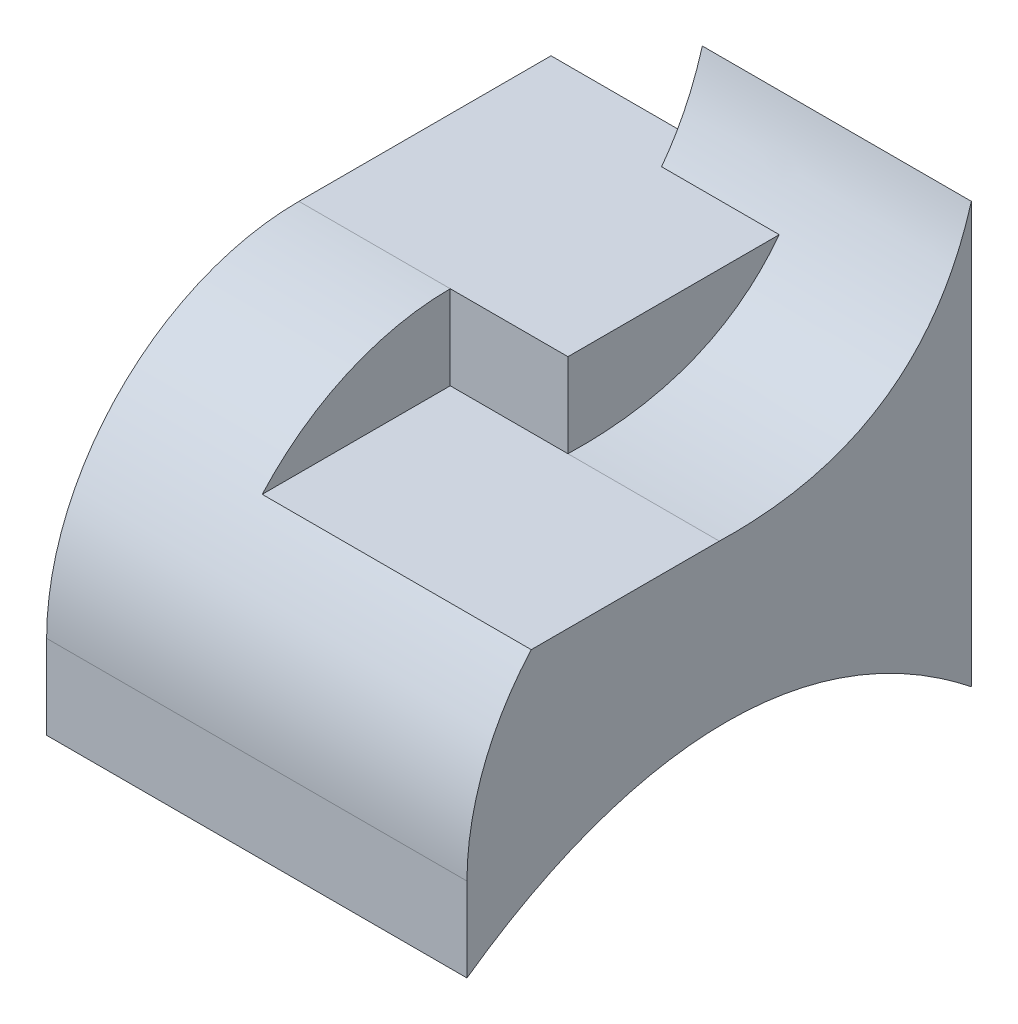
ISO-10303-21;
HEADER;
FILE_DESCRIPTION(('STEP AP214'),'2;1');
FILE_NAME('part.step','',(''),(''),'','','');
FILE_SCHEMA(('AUTOMOTIVE_DESIGN { 1 0 10303 214 1 1 1 1 }'));
ENDSEC;
DATA;
#1=APPLICATION_CONTEXT('core data for automotive mechanical design processes');
#2=APPLICATION_PROTOCOL_DEFINITION('international standard','automotive_design',2000,#1);
#3=PRODUCT_CONTEXT('',#1,'mechanical');
#4=PRODUCT('Part','Part','',(#3));
#5=PRODUCT_RELATED_PRODUCT_CATEGORY('part','',(#4));
#6=PRODUCT_DEFINITION_FORMATION('','',#4);
#7=PRODUCT_DEFINITION_CONTEXT('part definition',#1,'design');
#8=PRODUCT_DEFINITION('design','',#6,#7);
#9=PRODUCT_DEFINITION_SHAPE('','',#8);
#10=(LENGTH_UNIT() NAMED_UNIT(*) SI_UNIT(.MILLI.,.METRE.));
#11=(NAMED_UNIT(*) PLANE_ANGLE_UNIT() SI_UNIT($,.RADIAN.));
#12=(NAMED_UNIT(*) SI_UNIT($,.STERADIAN.) SOLID_ANGLE_UNIT());
#13=UNCERTAINTY_MEASURE_WITH_UNIT(LENGTH_MEASURE(1.E-05),#10,'distance_accuracy_value','');
#14=(GEOMETRIC_REPRESENTATION_CONTEXT(3) GLOBAL_UNCERTAINTY_ASSIGNED_CONTEXT((#13)) GLOBAL_UNIT_ASSIGNED_CONTEXT((#10,
#11,#12)) REPRESENTATION_CONTEXT('',''));
#15=CARTESIAN_POINT('',(0.,0.,0.));
#16=DIRECTION('',(0.,0.,1.));
#17=DIRECTION('',(1.,0.,0.));
#18=AXIS2_PLACEMENT_3D('',#15,#16,#17);
#19=CARTESIAN_POINT('',(3.2,0.,0.998443773012467));
#20=DIRECTION('',(0.,0.,-1.));
#21=DIRECTION('',(0.,1.,0.));
#22=AXIS2_PLACEMENT_3D('',#19,#20,#21);
#23=PLANE('',#22);
#24=DIRECTION('',(-1.,0.,0.));
#25=VECTOR('',#24,1.);
#26=CARTESIAN_POINT('',(5.,3.,0.998443773012467));
#27=LINE('',#26,#25);
#28=CARTESIAN_POINT('',(3.2,3.,0.998443773012467));
#29=VERTEX_POINT('',#28);
#30=CARTESIAN_POINT('',(1.8,3.,0.998443773012467));
#31=VERTEX_POINT('',#30);
#32=EDGE_CURVE('E299',#29,#31,#27,.T.);
#33=ORIENTED_EDGE('',*,*,#32,.F.);
#34=DIRECTION('',(0.,-1.,0.));
#35=VECTOR('',#34,1.);
#36=CARTESIAN_POINT('',(3.2,0.,0.998443773012467));
#37=LINE('',#36,#35);
#38=CARTESIAN_POINT('',(3.2,4.,0.998443773012467));
#39=VERTEX_POINT('',#38);
#40=EDGE_CURVE('E129',#39,#29,#37,.T.);
#41=ORIENTED_EDGE('',*,*,#40,.F.);
#42=DIRECTION('',(-1.,0.,0.));
#43=VECTOR('',#42,1.);
#44=CARTESIAN_POINT('',(3.2,4.,0.998443773012467));
#45=LINE('',#44,#43);
#46=CARTESIAN_POINT('',(1.8,4.,0.998443773012467));
#47=VERTEX_POINT('',#46);
#48=EDGE_CURVE('E64',#39,#47,#45,.T.);
#49=ORIENTED_EDGE('',*,*,#48,.T.);
#50=DIRECTION('',(0.,1.,0.));
#51=VECTOR('',#50,1.);
#52=CARTESIAN_POINT('',(1.8,0.,0.998443773012467));
#53=LINE('',#52,#51);
#54=EDGE_CURVE('E111',#31,#47,#53,.T.);
#55=ORIENTED_EDGE('',*,*,#54,.F.);
#56=EDGE_LOOP('',(#33,#41,#49,#55));
#57=FACE_BOUND('',#56,.T.);
#58=ADVANCED_FACE('F35',(#57),#23,.F.);
#59=CARTESIAN_POINT('',(3.2,0.,-2.00038877290963));
#60=CARTESIAN_POINT('',(3.2,2.19293429517951,0.759001549130415));
#61=CARTESIAN_POINT('',(3.2,0.,3.99961122709037));
#62=B_SPLINE_CURVE_WITH_KNOTS('',2,(#59,#60,#61),.UNSPECIFIED.,.F.,.F.,(3,3),(0.,1.),.UNSPECIFIED.);
#63=DIRECTION('',(-1.,0.,0.));
#64=VECTOR('',#63,1.);
#65=SURFACE_OF_LINEAR_EXTRUSION('',#62,#64);
#66=DIRECTION('',(-1.,0.,0.));
#67=VECTOR('',#66,1.);
#68=CARTESIAN_POINT('',(3.2,0.,-2.00038877290963));
#69=LINE('',#68,#67);
#70=CARTESIAN_POINT('',(1.8,0.,-2.00038877290963));
#71=VERTEX_POINT('',#70);
#72=CARTESIAN_POINT('',(0.,0.,-2.00038877290963));
#73=VERTEX_POINT('',#72);
#74=EDGE_CURVE('E47',#71,#73,#69,.T.);
#75=ORIENTED_EDGE('',*,*,#74,.F.);
#76=CARTESIAN_POINT('',(1.8,0.,-2.00038877290963));
#77=CARTESIAN_POINT('',(1.8,2.19293429517951,0.759001549130415));
#78=CARTESIAN_POINT('',(1.8,0.,3.99961122709037));
#79=B_SPLINE_CURVE_WITH_KNOTS('',2,(#76,#77,#78),.UNSPECIFIED.,.F.,.F.,(3,3),(0.,1.),.UNSPECIFIED.);
#80=CARTESIAN_POINT('',(1.8,1.09474341744829,0.998443773019641));
#81=VERTEX_POINT('',#80);
#82=EDGE_CURVE('E186',#71,#81,#79,.T.);
#83=ORIENTED_EDGE('',*,*,#82,.T.);
#84=DIRECTION('',(-1.,0.,0.));
#85=VECTOR('',#84,1.);
#86=CARTESIAN_POINT('',(1.8,1.09474341744843,0.998443773012467));
#87=LINE('',#86,#85);
#88=CARTESIAN_POINT('',(0.,1.09474341744843,0.998443773012467));
#89=VERTEX_POINT('',#88);
#90=EDGE_CURVE('E149',#81,#89,#87,.T.);
#91=ORIENTED_EDGE('',*,*,#90,.T.);
#92=CARTESIAN_POINT('',(0.,0.,-2.00038877290963));
#93=CARTESIAN_POINT('',(0.,2.19293429517951,0.759001549130415));
#94=CARTESIAN_POINT('',(0.,0.,3.99961122709037));
#95=B_SPLINE_CURVE_WITH_KNOTS('',2,(#92,#93,#94),.UNSPECIFIED.,.F.,.F.,(3,3),(0.,1.),.UNSPECIFIED.);
#96=EDGE_CURVE('E102',#73,#89,#95,.T.);
#97=ORIENTED_EDGE('',*,*,#96,.F.);
#98=EDGE_LOOP('',(#75,#83,#91,#97));
#99=FACE_BOUND('',#98,.T.);
#100=ADVANCED_FACE('F37',(#99),#65,.T.);
#101=CARTESIAN_POINT('',(3.2,4.,0.));
#102=DIRECTION('',(0.,1.,0.));
#103=DIRECTION('',(0.,0.,1.));
#104=AXIS2_PLACEMENT_3D('',#101,#102,#103);
#105=PLANE('',#104);
#106=DIRECTION('',(0.,0.,-1.));
#107=VECTOR('',#106,1.);
#108=CARTESIAN_POINT('',(3.2,4.,0.));
#109=LINE('',#108,#107);
#110=CARTESIAN_POINT('',(3.2,4.00000000968665,-1.51495017286256));
#111=VERTEX_POINT('',#110);
#112=EDGE_CURVE('E92',#39,#111,#109,.T.);
#113=ORIENTED_EDGE('',*,*,#112,.T.);
#114=DIRECTION('',(-1.,0.,0.));
#115=VECTOR('',#114,1.);
#116=CARTESIAN_POINT('',(5.,4.,-1.51495016551167));
#117=LINE('',#116,#115);
#118=CARTESIAN_POINT('',(1.8,4.00000000968665,-1.51495017286256));
#119=VERTEX_POINT('',#118);
#120=EDGE_CURVE('E289',#111,#119,#117,.T.);
#121=ORIENTED_EDGE('',*,*,#120,.T.);
#122=DIRECTION('',(0.,0.,-1.));
#123=VECTOR('',#122,1.);
#124=CARTESIAN_POINT('',(1.8,4.,0.));
#125=LINE('',#124,#123);
#126=CARTESIAN_POINT('',(1.8,4.,-2.00038877290963));
#127=VERTEX_POINT('',#126);
#128=EDGE_CURVE('E188',#119,#127,#125,.T.);
#129=ORIENTED_EDGE('',*,*,#128,.T.);
#130=DIRECTION('',(-1.,0.,0.));
#131=VECTOR('',#130,1.);
#132=CARTESIAN_POINT('',(3.2,4.,-2.00038877290963));
#133=LINE('',#132,#131);
#134=CARTESIAN_POINT('',(0.,4.,-2.00038877290963));
#135=VERTEX_POINT('',#134);
#136=EDGE_CURVE('E87',#127,#135,#133,.T.);
#137=ORIENTED_EDGE('',*,*,#136,.T.);
#138=DIRECTION('',(0.,0.,-1.));
#139=VECTOR('',#138,1.);
#140=CARTESIAN_POINT('',(0.,4.,0.));
#141=LINE('',#140,#139);
#142=CARTESIAN_POINT('',(0.,4.,0.998443773012467));
#143=VERTEX_POINT('',#142);
#144=EDGE_CURVE('E81',#143,#135,#141,.T.);
#145=ORIENTED_EDGE('',*,*,#144,.F.);
#146=DIRECTION('',(-1.,0.,0.));
#147=VECTOR('',#146,1.);
#148=CARTESIAN_POINT('',(1.8,4.,0.998443773012467));
#149=LINE('',#148,#147);
#150=EDGE_CURVE('E84',#47,#143,#149,.T.);
#151=ORIENTED_EDGE('',*,*,#150,.F.);
#152=ORIENTED_EDGE('',*,*,#48,.F.);
#153=EDGE_LOOP('',(#113,#121,#129,#137,#145,#151,#152));
#154=FACE_BOUND('',#153,.T.);
#155=ADVANCED_FACE('F83',(#154),#105,.T.);
#156=CARTESIAN_POINT('',(3.2,0.,0.));
#157=DIRECTION('',(1.,0.,0.));
#158=DIRECTION('',(0.,0.,-1.));
#159=AXIS2_PLACEMENT_3D('',#156,#157,#158);
#160=PLANE('',#159);
#161=ORIENTED_EDGE('',*,*,#40,.T.);
#162=CARTESIAN_POINT('',(3.2,5.00085656886673,-2.00038877290963));
#163=CARTESIAN_POINT('',(3.2,2.93147543190315,-1.39753577973207));
#164=CARTESIAN_POINT('',(3.2,3.,0.998443773012467));
#165=B_SPLINE_CURVE_WITH_KNOTS('',2,(#162,#163,#164),.UNSPECIFIED.,.F.,.F.,(3,3),(0.,1.),.UNSPECIFIED.);
#166=EDGE_CURVE('E285',#29,#111,#165,.F.);
#167=ORIENTED_EDGE('',*,*,#166,.T.);
#168=ORIENTED_EDGE('',*,*,#112,.F.);
#169=EDGE_LOOP('',(#161,#167,#168));
#170=FACE_BOUND('',#169,.T.);
#171=ADVANCED_FACE('F212',(#170),#160,.T.);
#172=CARTESIAN_POINT('',(1.8,0.,0.));
#173=DIRECTION('',(-1.,0.,0.));
#174=DIRECTION('',(0.,0.,1.));
#175=AXIS2_PLACEMENT_3D('',#172,#173,#174);
#176=PLANE('',#175);
#177=DIRECTION('',(0.,0.,1.));
#178=VECTOR('',#177,1.);
#179=CARTESIAN_POINT('',(1.8,3.,0.));
#180=LINE('',#179,#178);
#181=CARTESIAN_POINT('',(1.8,3.,3.23496595014368));
#182=VERTEX_POINT('',#181);
#183=EDGE_CURVE('E259',#31,#182,#180,.T.);
#184=ORIENTED_EDGE('',*,*,#183,.F.);
#185=ORIENTED_EDGE('',*,*,#54,.T.);
#186=CARTESIAN_POINT('',(1.8,0.998709843022222,0.998321070112596));
#187=DIRECTION('',(-1.,0.,0.));
#188=DIRECTION('',(0.,0.,1.));
#189=AXIS2_PLACEMENT_3D('',#186,#187,#188);
#190=CIRCLE('',#189,3.00129015787968);
#191=EDGE_CURVE('E100',#182,#47,#190,.T.);
#192=ORIENTED_EDGE('',*,*,#191,.F.);
#193=EDGE_LOOP('',(#184,#185,#192));
#194=FACE_BOUND('',#193,.T.);
#195=ADVANCED_FACE('F215',(#194),#176,.F.);
#196=CARTESIAN_POINT('',(3.2,0.,-2.00038877290963));
#197=DIRECTION('',(0.,0.,-1.));
#198=DIRECTION('',(-1.,0.,0.));
#199=AXIS2_PLACEMENT_3D('',#196,#197,#198);
#200=PLANE('',#199);
#201=CARTESIAN_POINT('',(5.,0.,-2.00038877290963));
#202=VERTEX_POINT('',#201);
#203=EDGE_CURVE('E11',#202,#71,#69,.T.);
#204=ORIENTED_EDGE('',*,*,#203,.T.);
#205=ORIENTED_EDGE('',*,*,#74,.T.);
#206=DIRECTION('',(0.,-1.,0.));
#207=VECTOR('',#206,1.);
#208=CARTESIAN_POINT('',(0.,0.,-2.00038877290963));
#209=LINE('',#208,#207);
#210=EDGE_CURVE('E93',#135,#73,#209,.T.);
#211=ORIENTED_EDGE('',*,*,#210,.F.);
#212=ORIENTED_EDGE('',*,*,#136,.F.);
#213=DIRECTION('',(0.,1.,0.));
#214=VECTOR('',#213,1.);
#215=CARTESIAN_POINT('',(1.8,0.,-2.00038877290963));
#216=LINE('',#215,#214);
#217=CARTESIAN_POINT('',(1.8,5.00085656886673,-2.00038877290963));
#218=VERTEX_POINT('',#217);
#219=EDGE_CURVE('E176',#127,#218,#216,.T.);
#220=ORIENTED_EDGE('',*,*,#219,.T.);
#221=DIRECTION('',(-1.,0.,0.));
#222=VECTOR('',#221,1.);
#223=CARTESIAN_POINT('',(5.,5.00085656886673,-2.00038877290963));
#224=LINE('',#223,#222);
#225=CARTESIAN_POINT('',(5.,5.00085656886673,-2.00038877290963));
#226=VERTEX_POINT('',#225);
#227=EDGE_CURVE('E286',#226,#218,#224,.T.);
#228=ORIENTED_EDGE('',*,*,#227,.F.);
#229=DIRECTION('',(0.,1.,0.));
#230=VECTOR('',#229,1.);
#231=CARTESIAN_POINT('',(5.,0.,-2.00038877290963));
#232=LINE('',#231,#230);
#233=EDGE_CURVE('E239',#202,#226,#232,.T.);
#234=ORIENTED_EDGE('',*,*,#233,.F.);
#235=EDGE_LOOP('',(#204,#205,#211,#212,#220,#228,#234));
#236=FACE_BOUND('',#235,.T.);
#237=ADVANCED_FACE('F219',(#236),#200,.T.);
#238=CARTESIAN_POINT('',(0.,0.,0.));
#239=DIRECTION('',(1.,0.,0.));
#240=DIRECTION('',(0.,0.,-1.));
#241=AXIS2_PLACEMENT_3D('',#238,#239,#240);
#242=PLANE('',#241);
#243=ORIENTED_EDGE('',*,*,#96,.T.);
#244=CARTESIAN_POINT('',(0.,-6.0818017291688E-10,-2.00038877361408));
#245=CARTESIAN_POINT('',(0.,0.0384968697528258,-1.95194779127023));
#246=CARTESIAN_POINT('',(0.,1.53765621584237,-0.010050324715731));
#247=CARTESIAN_POINT('',(0.,1.34308431968852,2.11047516855166));
#248=CARTESIAN_POINT('',(0.,0.,3.99961122638592));
#249=B_SPLINE_CURVE_WITH_KNOTS('',3,(#244,#245,#246,#247,#248),.UNSPECIFIED.,.F.,.F.,(4,1,4),
(0.,0.024991414491378,1.),.UNSPECIFIED.);
#250=CARTESIAN_POINT('',(0.,0.,3.99961122709037));
#251=VERTEX_POINT('',#250);
#252=EDGE_CURVE('E115',#89,#251,#249,.T.);
#253=ORIENTED_EDGE('',*,*,#252,.T.);
#254=DIRECTION('',(0.,1.,-7.05365623463801E-10));
#255=VECTOR('',#254,1.);
#256=CARTESIAN_POINT('',(0.,2.82118826680942E-09,3.99961122709037));
#257=LINE('',#256,#255);
#258=CARTESIAN_POINT('',(0.,0.998709843022353,3.99961122638592));
#259=VERTEX_POINT('',#258);
#260=EDGE_CURVE('E110',#251,#259,#257,.T.);
#261=ORIENTED_EDGE('',*,*,#260,.T.);
#262=CARTESIAN_POINT('',(0.,0.998709843022222,0.998321070112596));
#263=DIRECTION('',(-1.,0.,0.));
#264=DIRECTION('',(0.,0.,1.));
#265=AXIS2_PLACEMENT_3D('',#262,#263,#264);
#266=CIRCLE('',#265,3.00129015787968);
#267=EDGE_CURVE('E98',#259,#143,#266,.T.);
#268=ORIENTED_EDGE('',*,*,#267,.T.);
#269=ORIENTED_EDGE('',*,*,#144,.T.);
#270=ORIENTED_EDGE('',*,*,#210,.T.);
#271=EDGE_LOOP('',(#243,#253,#261,#268,#269,#270));
#272=FACE_BOUND('',#271,.T.);
#273=ADVANCED_FACE('F107',(#272),#242,.F.);
#274=CARTESIAN_POINT('',(1.8,0.998709843022222,0.998321070112596));
#275=DIRECTION('',(-1.,0.,0.));
#276=DIRECTION('',(0.,0.,1.));
#277=AXIS2_PLACEMENT_3D('',#274,#275,#276);
#278=CYLINDRICAL_SURFACE('',#277,3.00129015787968);
#279=ORIENTED_EDGE('',*,*,#267,.F.);
#280=DIRECTION('',(-1.,0.,0.));
#281=VECTOR('',#280,1.);
#282=CARTESIAN_POINT('',(1.8,0.998709843022353,3.99961122638592));
#283=LINE('',#282,#281);
#284=CARTESIAN_POINT('',(5.,0.998709843022353,3.99961122638592));
#285=VERTEX_POINT('',#284);
#286=EDGE_CURVE('E103',#285,#259,#283,.T.);
#287=ORIENTED_EDGE('',*,*,#286,.F.);
#288=CARTESIAN_POINT('',(5.,0.998709843022222,0.998321070112596));
#289=DIRECTION('',(1.,0.,0.));
#290=DIRECTION('',(0.,0.,-1.));
#291=AXIS2_PLACEMENT_3D('',#288,#289,#290);
#292=CIRCLE('',#291,3.00129015787968);
#293=CARTESIAN_POINT('',(5.,3.,3.23496595014368));
#294=VERTEX_POINT('',#293);
#295=EDGE_CURVE('E317',#294,#285,#292,.T.);
#296=ORIENTED_EDGE('',*,*,#295,.F.);
#297=DIRECTION('',(-1.,0.,0.));
#298=VECTOR('',#297,1.);
#299=CARTESIAN_POINT('',(5.,3.,3.23496595014368));
#300=LINE('',#299,#298);
#301=EDGE_CURVE('E55',#294,#182,#300,.T.);
#302=ORIENTED_EDGE('',*,*,#301,.T.);
#303=ORIENTED_EDGE('',*,*,#191,.T.);
#304=ORIENTED_EDGE('',*,*,#150,.T.);
#305=EDGE_LOOP('',(#279,#287,#296,#302,#303,#304));
#306=FACE_BOUND('',#305,.T.);
#307=ADVANCED_FACE('F96',(#306),#278,.T.);
#308=CARTESIAN_POINT('',(1.8,2.82118826680942E-09,3.99961122709037));
#309=DIRECTION('',(0.,7.05365623463801E-10,1.));
#310=DIRECTION('',(0.,-1.,7.05365623463801E-10));
#311=AXIS2_PLACEMENT_3D('',#308,#309,#310);
#312=PLANE('',#311);
#313=ORIENTED_EDGE('',*,*,#260,.F.);
#314=DIRECTION('',(-1.,0.,0.));
#315=VECTOR('',#314,1.);
#316=CARTESIAN_POINT('',(1.8,0.,3.99961122709037));
#317=LINE('',#316,#315);
#318=CARTESIAN_POINT('',(1.8,0.,3.99961122638592));
#319=VERTEX_POINT('',#318);
#320=EDGE_CURVE('E120',#319,#251,#317,.T.);
#321=ORIENTED_EDGE('',*,*,#320,.F.);
#322=DIRECTION('',(-1.,0.,0.));
#323=VECTOR('',#322,1.);
#324=CARTESIAN_POINT('',(5.,0.,3.99961122638592));
#325=LINE('',#324,#323);
#326=CARTESIAN_POINT('',(5.,0.,3.99961122638592));
#327=VERTEX_POINT('',#326);
#328=EDGE_CURVE('E183',#327,#319,#325,.T.);
#329=ORIENTED_EDGE('',*,*,#328,.F.);
#330=DIRECTION('',(0.,-1.,7.05365623463801E-10));
#331=VECTOR('',#330,1.);
#332=CARTESIAN_POINT('',(5.,2.82118826680942E-09,3.99961122709037));
#333=LINE('',#332,#331);
#334=EDGE_CURVE('E255',#285,#327,#333,.T.);
#335=ORIENTED_EDGE('',*,*,#334,.F.);
#336=ORIENTED_EDGE('',*,*,#286,.T.);
#337=EDGE_LOOP('',(#313,#321,#329,#335,#336));
#338=FACE_BOUND('',#337,.T.);
#339=ADVANCED_FACE('F180',(#338),#312,.T.);
#340=CARTESIAN_POINT('',(1.8,-6.0818017291688E-10,-2.00038877361408));
#341=CARTESIAN_POINT('',(1.8,0.0384968697528258,-1.95194779127023));
#342=CARTESIAN_POINT('',(1.8,1.53765621584237,-0.010050324715731));
#343=CARTESIAN_POINT('',(1.8,1.34308431968852,2.11047516855166));
#344=CARTESIAN_POINT('',(1.8,0.,3.99961122638592));
#345=B_SPLINE_CURVE_WITH_KNOTS('',3,(#340,#341,#342,#343,#344),.UNSPECIFIED.,.F.,.F.,(4,1,4),
(0.,0.024991414491378,1.),.UNSPECIFIED.);
#346=DIRECTION('',(-1.,0.,0.));
#347=VECTOR('',#346,1.);
#348=SURFACE_OF_LINEAR_EXTRUSION('',#345,#347);
#349=ORIENTED_EDGE('',*,*,#252,.F.);
#350=ORIENTED_EDGE('',*,*,#90,.F.);
#351=CARTESIAN_POINT('',(1.8,1.09470558690868,1.00034812833686));
#352=VERTEX_POINT('',#351);
#353=EDGE_CURVE('E113',#81,#352,#345,.T.);
#354=ORIENTED_EDGE('',*,*,#353,.T.);
#355=CARTESIAN_POINT('',(1.8,0.,3.99961122709037));
#356=CARTESIAN_POINT('',(1.8,0.689234167858044,3.03057006386221));
#357=CARTESIAN_POINT('',(1.8,1.07431234112784,2.01544538122989));
#358=CARTESIAN_POINT('',(1.8,1.09470558690859,1.0003481283413));
#359=B_SPLINE_CURVE_WITH_KNOTS('',3,(#355,#356,#357,#358),.UNSPECIFIED.,.F.,.F.,(4,4),(0.,
0.499859126314224),.UNSPECIFIED.);
#360=EDGE_CURVE('E163',#319,#352,#359,.T.);
#361=ORIENTED_EDGE('',*,*,#360,.F.);
#362=ORIENTED_EDGE('',*,*,#320,.T.);
#363=EDGE_LOOP('',(#349,#350,#354,#361,#362));
#364=FACE_BOUND('',#363,.T.);
#365=ADVANCED_FACE('F166',(#364),#348,.T.);
#366=CARTESIAN_POINT('',(5.,0.,3.99961122709037));
#367=CARTESIAN_POINT('',(5.,1.37885682500228,2.06098269714132));
#368=CARTESIAN_POINT('',(5.,1.54040382059394,-0.0620838256227896));
#369=CARTESIAN_POINT('',(5.,0.,-2.00038877290963));
#370=B_SPLINE_CURVE_WITH_KNOTS('',3,(#366,#367,#368,#369),.UNSPECIFIED.,.F.,.F.,(4,4),(0.,1.),.UNSPECIFIED.);
#371=DIRECTION('',(-1.,0.,0.));
#372=VECTOR('',#371,1.);
#373=SURFACE_OF_LINEAR_EXTRUSION('',#370,#372);
#374=ORIENTED_EDGE('',*,*,#203,.F.);
#375=EDGE_CURVE('E246',#327,#202,#370,.T.);
#376=ORIENTED_EDGE('',*,*,#375,.F.);
#377=ORIENTED_EDGE('',*,*,#328,.T.);
#378=ORIENTED_EDGE('',*,*,#360,.T.);
#379=ORIENTED_EDGE('',*,*,#353,.F.);
#380=CARTESIAN_POINT('',(1.8,0.,3.99961122709037));
#381=CARTESIAN_POINT('',(1.8,1.37885682500228,2.06098269714132));
#382=CARTESIAN_POINT('',(1.8,1.54040382059394,-0.0620838256227896));
#383=CARTESIAN_POINT('',(1.8,0.,-2.00038877290963));
#384=B_SPLINE_CURVE_WITH_KNOTS('',3,(#380,#381,#382,#383),.UNSPECIFIED.,.F.,.F.,(4,4),(0.,1.),.UNSPECIFIED.);
#385=EDGE_CURVE('E177',#81,#71,#384,.T.);
#386=ORIENTED_EDGE('',*,*,#385,.T.);
#387=EDGE_LOOP('',(#374,#376,#377,#378,#379,#386));
#388=FACE_BOUND('',#387,.T.);
#389=ADVANCED_FACE('F210',(#388),#373,.F.);
#390=CARTESIAN_POINT('',(1.8,0.,0.));
#391=DIRECTION('',(1.,0.,0.));
#392=DIRECTION('',(0.,0.,-1.));
#393=AXIS2_PLACEMENT_3D('',#390,#391,#392);
#394=PLANE('',#393);
#395=ORIENTED_EDGE('',*,*,#82,.F.);
#396=ORIENTED_EDGE('',*,*,#385,.F.);
#397=EDGE_LOOP('',(#395,#396));
#398=FACE_BOUND('',#397,.T.);
#399=ADVANCED_FACE('F272',(#398),#394,.F.);
#400=CARTESIAN_POINT('',(5.,5.00085656886673,-2.00038877290963));
#401=CARTESIAN_POINT('',(5.,2.93147543190315,-1.39753577973207));
#402=CARTESIAN_POINT('',(5.,3.,0.998443773012467));
#403=B_SPLINE_CURVE_WITH_KNOTS('',2,(#400,#401,#402),.UNSPECIFIED.,.F.,.F.,(3,3),(0.,1.),.UNSPECIFIED.);
#404=DIRECTION('',(-1.,0.,0.));
#405=VECTOR('',#404,1.);
#406=SURFACE_OF_LINEAR_EXTRUSION('',#403,#405);
#407=ORIENTED_EDGE('',*,*,#120,.F.);
#408=ORIENTED_EDGE('',*,*,#166,.F.);
#409=CARTESIAN_POINT('',(5.,3.,0.998443773012467));
#410=VERTEX_POINT('',#409);
#411=EDGE_CURVE('E292',#410,#29,#27,.T.);
#412=ORIENTED_EDGE('',*,*,#411,.F.);
#413=EDGE_CURVE('E257',#226,#410,#403,.T.);
#414=ORIENTED_EDGE('',*,*,#413,.F.);
#415=ORIENTED_EDGE('',*,*,#227,.T.);
#416=CARTESIAN_POINT('',(1.8,5.00085656886673,-2.00038877290963));
#417=CARTESIAN_POINT('',(1.8,2.93147543190315,-1.39753577973207));
#418=CARTESIAN_POINT('',(1.8,3.,0.998443773012467));
#419=B_SPLINE_CURVE_WITH_KNOTS('',2,(#416,#417,#418),.UNSPECIFIED.,.F.,.F.,(3,3),(0.,1.),.UNSPECIFIED.);
#420=EDGE_CURVE('E324',#218,#119,#419,.T.);
#421=ORIENTED_EDGE('',*,*,#420,.T.);
#422=EDGE_LOOP('',(#407,#408,#412,#414,#415,#421));
#423=FACE_BOUND('',#422,.T.);
#424=ADVANCED_FACE('F273',(#423),#406,.F.);
#425=CARTESIAN_POINT('',(5.,3.,0.));
#426=DIRECTION('',(0.,-1.,0.));
#427=DIRECTION('',(0.,0.,-1.));
#428=AXIS2_PLACEMENT_3D('',#425,#426,#427);
#429=PLANE('',#428);
#430=ORIENTED_EDGE('',*,*,#183,.T.);
#431=ORIENTED_EDGE('',*,*,#301,.F.);
#432=DIRECTION('',(0.,0.,1.));
#433=VECTOR('',#432,1.);
#434=CARTESIAN_POINT('',(5.,3.,0.));
#435=LINE('',#434,#433);
#436=EDGE_CURVE('E332',#410,#294,#435,.T.);
#437=ORIENTED_EDGE('',*,*,#436,.F.);
#438=ORIENTED_EDGE('',*,*,#411,.T.);
#439=ORIENTED_EDGE('',*,*,#32,.T.);
#440=EDGE_LOOP('',(#430,#431,#437,#438,#439));
#441=FACE_BOUND('',#440,.T.);
#442=ADVANCED_FACE('F351',(#441),#429,.F.);
#443=CARTESIAN_POINT('',(5.,0.,0.));
#444=DIRECTION('',(1.,0.,0.));
#445=DIRECTION('',(0.,0.,-1.));
#446=AXIS2_PLACEMENT_3D('',#443,#444,#445);
#447=PLANE('',#446);
#448=ORIENTED_EDGE('',*,*,#334,.T.);
#449=ORIENTED_EDGE('',*,*,#375,.T.);
#450=ORIENTED_EDGE('',*,*,#233,.T.);
#451=ORIENTED_EDGE('',*,*,#413,.T.);
#452=ORIENTED_EDGE('',*,*,#436,.T.);
#453=ORIENTED_EDGE('',*,*,#295,.T.);
#454=EDGE_LOOP('',(#448,#449,#450,#451,#452,#453));
#455=FACE_BOUND('',#454,.T.);
#456=ADVANCED_FACE('F252',(#455),#447,.T.);
#457=ORIENTED_EDGE('',*,*,#128,.F.);
#458=ORIENTED_EDGE('',*,*,#420,.F.);
#459=ORIENTED_EDGE('',*,*,#219,.F.);
#460=EDGE_LOOP('',(#457,#458,#459));
#461=FACE_BOUND('',#460,.T.);
#462=ADVANCED_FACE('F371',(#461),#394,.F.);
#463=CLOSED_SHELL('',(#58,#100,#155,#171,#195,#237,#273,#307,#339,#365,#389,#399,#424,#442,#456,#462));
#464=MANIFOLD_SOLID_BREP('B2',#463);
#465=ADVANCED_BREP_SHAPE_REPRESENTATION('',(#18,#464),#14);
#466=SHAPE_DEFINITION_REPRESENTATION(#9,#465);
ENDSEC;
END-ISO-10303-21;
